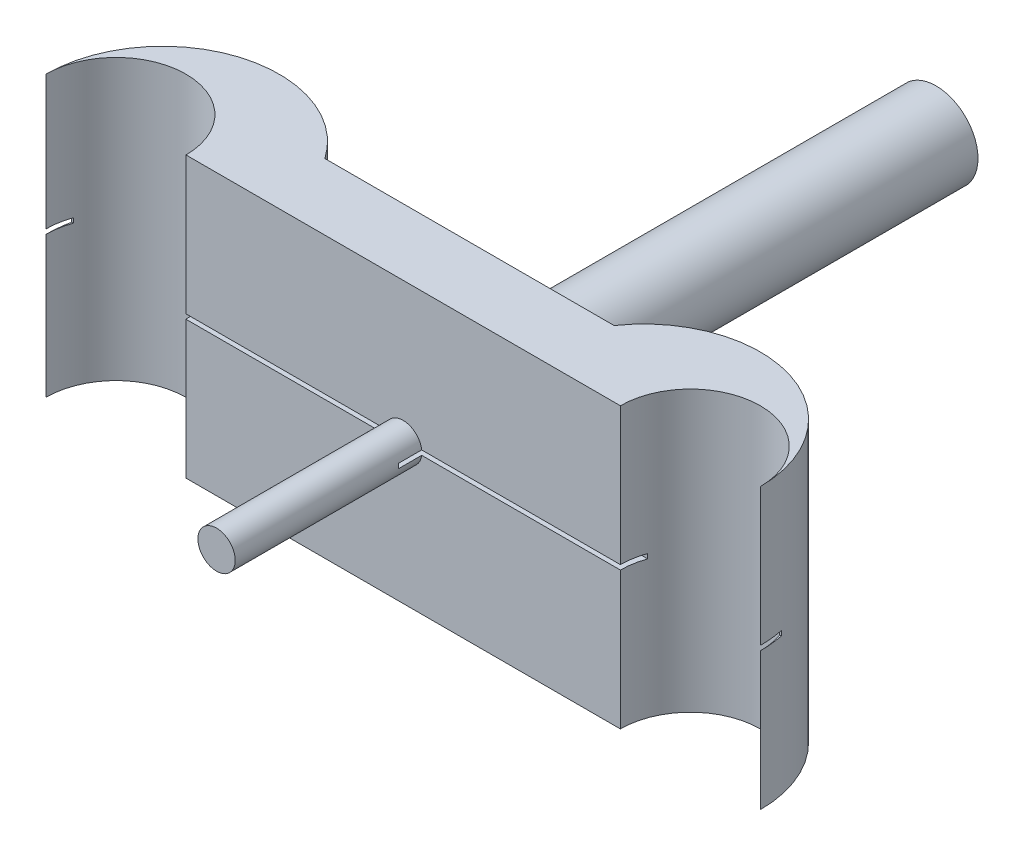
ISO-10303-21;
HEADER;
FILE_DESCRIPTION(('STEP AP214'),'2;1');
FILE_NAME('part.step','',(''),(''),'','','');
FILE_SCHEMA(('AUTOMOTIVE_DESIGN { 1 0 10303 214 1 1 1 1 }'));
ENDSEC;
DATA;
#1=APPLICATION_CONTEXT('core data for automotive mechanical design processes');
#2=APPLICATION_PROTOCOL_DEFINITION('international standard','automotive_design',2000,#1);
#3=PRODUCT_CONTEXT('',#1,'mechanical');
#4=PRODUCT('Part','Part','',(#3));
#5=PRODUCT_RELATED_PRODUCT_CATEGORY('part','',(#4));
#6=PRODUCT_DEFINITION_FORMATION('','',#4);
#7=PRODUCT_DEFINITION_CONTEXT('part definition',#1,'design');
#8=PRODUCT_DEFINITION('design','',#6,#7);
#9=PRODUCT_DEFINITION_SHAPE('','',#8);
#10=(LENGTH_UNIT() NAMED_UNIT(*) SI_UNIT(.MILLI.,.METRE.));
#11=(NAMED_UNIT(*) PLANE_ANGLE_UNIT() SI_UNIT($,.RADIAN.));
#12=(NAMED_UNIT(*) SI_UNIT($,.STERADIAN.) SOLID_ANGLE_UNIT());
#13=UNCERTAINTY_MEASURE_WITH_UNIT(LENGTH_MEASURE(1.E-05),#10,'distance_accuracy_value','');
#14=(GEOMETRIC_REPRESENTATION_CONTEXT(3) GLOBAL_UNCERTAINTY_ASSIGNED_CONTEXT((#13)) GLOBAL_UNIT_ASSIGNED_CONTEXT((#10,
#11,#12)) REPRESENTATION_CONTEXT('',''));
#15=CARTESIAN_POINT('',(0.,0.,0.));
#16=DIRECTION('',(0.,0.,1.));
#17=DIRECTION('',(1.,0.,0.));
#18=AXIS2_PLACEMENT_3D('',#15,#16,#17);
#19=CARTESIAN_POINT('',(0.,30.,0.));
#20=DIRECTION('',(0.,-1.,0.));
#21=DIRECTION('',(0.,0.,-1.));
#22=AXIS2_PLACEMENT_3D('',#19,#20,#21);
#23=CYLINDRICAL_SURFACE('',#22,7.5);
#24=CARTESIAN_POINT('',(0.,14.75,0.));
#25=DIRECTION('',(0.,1.,0.));
#26=DIRECTION('',(0.,0.,1.));
#27=AXIS2_PLACEMENT_3D('',#24,#25,#26);
#28=CIRCLE('',#27,7.5);
#29=CARTESIAN_POINT('',(7.07106781186548,14.75,-2.50000000000001));
#30=VERTEX_POINT('',#29);
#31=CARTESIAN_POINT('',(7.5,14.75,0.));
#32=VERTEX_POINT('',#31);
#33=EDGE_CURVE('E236',#30,#32,#28,.F.);
#34=ORIENTED_EDGE('',*,*,#33,.F.);
#35=DIRECTION('',(0.,-1.,0.));
#36=VECTOR('',#35,1.);
#37=CARTESIAN_POINT('',(7.07106781186547,30.,-2.50000000000001));
#38=LINE('',#37,#36);
#39=CARTESIAN_POINT('',(7.07106781186548,15.25,-2.50000000000001));
#40=VERTEX_POINT('',#39);
#41=EDGE_CURVE('E203',#40,#30,#38,.T.);
#42=ORIENTED_EDGE('',*,*,#41,.F.);
#43=CARTESIAN_POINT('',(0.,15.25,0.));
#44=DIRECTION('',(0.,-1.,0.));
#45=DIRECTION('',(0.,0.,-1.));
#46=AXIS2_PLACEMENT_3D('',#43,#44,#45);
#47=CIRCLE('',#46,7.5);
#48=CARTESIAN_POINT('',(7.5,15.25,0.));
#49=VERTEX_POINT('',#48);
#50=EDGE_CURVE('E208',#49,#40,#47,.F.);
#51=ORIENTED_EDGE('',*,*,#50,.F.);
#52=DIRECTION('',(0.,-1.,0.));
#53=VECTOR('',#52,1.);
#54=CARTESIAN_POINT('',(7.5,30.,0.));
#55=LINE('',#54,#53);
#56=CARTESIAN_POINT('',(7.5,30.,0.));
#57=VERTEX_POINT('',#56);
#58=EDGE_CURVE('E391',#57,#49,#55,.T.);
#59=ORIENTED_EDGE('',*,*,#58,.F.);
#60=CARTESIAN_POINT('',(0.,30.,0.));
#61=DIRECTION('',(0.,-1.,0.));
#62=DIRECTION('',(0.,0.,1.));
#63=AXIS2_PLACEMENT_3D('',#60,#61,#62);
#64=CIRCLE('',#63,7.5);
#65=CARTESIAN_POINT('',(-7.5,30.,0.));
#66=VERTEX_POINT('',#65);
#67=EDGE_CURVE('E480',#66,#57,#64,.T.);
#68=ORIENTED_EDGE('',*,*,#67,.F.);
#69=DIRECTION('',(0.,-1.,0.));
#70=VECTOR('',#69,1.);
#71=CARTESIAN_POINT('',(-7.5,30.,0.));
#72=LINE('',#71,#70);
#73=CARTESIAN_POINT('',(-7.5,15.6319903693811,0.));
#74=VERTEX_POINT('',#73);
#75=EDGE_CURVE('E390',#66,#74,#72,.T.);
#76=ORIENTED_EDGE('',*,*,#75,.T.);
#77=CARTESIAN_POINT('',(0.,15.6319903693811,0.));
#78=DIRECTION('',(0.,1.,0.));
#79=DIRECTION('',(0.,0.,1.));
#80=AXIS2_PLACEMENT_3D('',#77,#78,#79);
#81=CIRCLE('',#80,7.5);
#82=CARTESIAN_POINT('',(-7.07106781186547,15.6319903693811,-2.5));
#83=VERTEX_POINT('',#82);
#84=EDGE_CURVE('E407',#74,#83,#81,.F.);
#85=ORIENTED_EDGE('',*,*,#84,.T.);
#86=DIRECTION('',(0.,-1.,0.));
#87=VECTOR('',#86,1.);
#88=CARTESIAN_POINT('',(-7.07106781186547,30.,-2.50000000000002));
#89=LINE('',#88,#87);
#90=CARTESIAN_POINT('',(-7.07106781186547,15.1319903693811,-2.5));
#91=VERTEX_POINT('',#90);
#92=EDGE_CURVE('E411',#83,#91,#89,.T.);
#93=ORIENTED_EDGE('',*,*,#92,.T.);
#94=CARTESIAN_POINT('',(0.,15.1319903693811,0.));
#95=DIRECTION('',(0.,-1.,0.));
#96=DIRECTION('',(0.,0.,-1.));
#97=AXIS2_PLACEMENT_3D('',#94,#95,#96);
#98=CIRCLE('',#97,7.5);
#99=CARTESIAN_POINT('',(-7.5,15.1319903693811,0.));
#100=VERTEX_POINT('',#99);
#101=EDGE_CURVE('E415',#91,#100,#98,.F.);
#102=ORIENTED_EDGE('',*,*,#101,.T.);
#103=CARTESIAN_POINT('',(-7.5,0.,0.));
#104=VERTEX_POINT('',#103);
#105=EDGE_CURVE('E382',#100,#104,#72,.T.);
#106=ORIENTED_EDGE('',*,*,#105,.T.);
#107=CARTESIAN_POINT('',(0.,0.,0.));
#108=DIRECTION('',(0.,-1.,0.));
#109=DIRECTION('',(0.,0.,1.));
#110=AXIS2_PLACEMENT_3D('',#107,#108,#109);
#111=CIRCLE('',#110,7.5);
#112=CARTESIAN_POINT('',(7.5,0.,0.));
#113=VERTEX_POINT('',#112);
#114=EDGE_CURVE('E499',#104,#113,#111,.T.);
#115=ORIENTED_EDGE('',*,*,#114,.T.);
#116=EDGE_CURVE('E399',#32,#113,#55,.T.);
#117=ORIENTED_EDGE('',*,*,#116,.F.);
#118=EDGE_LOOP('',(#34,#42,#51,#59,#68,#76,#85,#93,#102,#106,#115,#117));
#119=FACE_BOUND('',#118,.T.);
#120=ADVANCED_FACE('F55',(#119),#23,.F.);
#121=CARTESIAN_POINT('',(7.5,30.,0.));
#122=DIRECTION('',(0.,0.,-1.));
#123=DIRECTION('',(-1.,0.,0.));
#124=AXIS2_PLACEMENT_3D('',#121,#122,#123);
#125=PLANE('',#124);
#126=DIRECTION('',(1.,0.,0.));
#127=VECTOR('',#126,1.);
#128=CARTESIAN_POINT('',(7.5,14.75,0.));
#129=LINE('',#128,#127);
#130=CARTESIAN_POINT('',(28.7956865167016,14.75,0.));
#131=VERTEX_POINT('',#130);
#132=EDGE_CURVE('E233',#32,#131,#129,.T.);
#133=ORIENTED_EDGE('',*,*,#132,.F.);
#134=ORIENTED_EDGE('',*,*,#116,.T.);
#135=DIRECTION('',(1.,0.,0.));
#136=VECTOR('',#135,1.);
#137=CARTESIAN_POINT('',(7.5,0.,0.));
#138=LINE('',#137,#136);
#139=CARTESIAN_POINT('',(54.06,0.,0.));
#140=VERTEX_POINT('',#139);
#141=EDGE_CURVE('E503',#113,#140,#138,.T.);
#142=ORIENTED_EDGE('',*,*,#141,.T.);
#143=DIRECTION('',(0.,-1.,0.));
#144=VECTOR('',#143,1.);
#145=CARTESIAN_POINT('',(54.06,30.,0.));
#146=LINE('',#145,#144);
#147=CARTESIAN_POINT('',(54.06,14.75,0.));
#148=VERTEX_POINT('',#147);
#149=EDGE_CURVE('E457',#148,#140,#146,.T.);
#150=ORIENTED_EDGE('',*,*,#149,.F.);
#151=CARTESIAN_POINT('',(32.7643134832984,14.75,0.));
#152=VERTEX_POINT('',#151);
#153=EDGE_CURVE('E237',#152,#148,#129,.T.);
#154=ORIENTED_EDGE('',*,*,#153,.F.);
#155=CARTESIAN_POINT('',(30.78,15.,0.));
#156=DIRECTION('',(0.,0.,-1.));
#157=DIRECTION('',(-1.,0.,0.));
#158=AXIS2_PLACEMENT_3D('',#155,#156,#157);
#159=CIRCLE('',#158,2.);
#160=EDGE_CURVE('E403',#131,#152,#159,.F.);
#161=ORIENTED_EDGE('',*,*,#160,.F.);
#162=EDGE_LOOP('',(#133,#134,#142,#150,#154,#161));
#163=FACE_BOUND('',#162,.T.);
#164=ADVANCED_FACE('F356',(#163),#125,.F.);
#165=DIRECTION('',(-1.,0.,0.));
#166=VECTOR('',#165,1.);
#167=CARTESIAN_POINT('',(7.5,15.25,0.));
#168=LINE('',#167,#166);
#169=CARTESIAN_POINT('',(54.06,15.25,0.));
#170=VERTEX_POINT('',#169);
#171=CARTESIAN_POINT('',(32.7643134832984,15.25,0.));
#172=VERTEX_POINT('',#171);
#173=EDGE_CURVE('E76',#170,#172,#168,.T.);
#174=ORIENTED_EDGE('',*,*,#173,.F.);
#175=CARTESIAN_POINT('',(54.06,30.,0.));
#176=VERTEX_POINT('',#175);
#177=EDGE_CURVE('E215',#176,#170,#146,.T.);
#178=ORIENTED_EDGE('',*,*,#177,.F.);
#179=DIRECTION('',(1.,0.,0.));
#180=VECTOR('',#179,1.);
#181=CARTESIAN_POINT('',(7.5,30.,0.));
#182=LINE('',#181,#180);
#183=EDGE_CURVE('E476',#57,#176,#182,.T.);
#184=ORIENTED_EDGE('',*,*,#183,.F.);
#185=ORIENTED_EDGE('',*,*,#58,.T.);
#186=CARTESIAN_POINT('',(28.7956865167016,15.25,0.));
#187=VERTEX_POINT('',#186);
#188=EDGE_CURVE('E222',#187,#49,#168,.T.);
#189=ORIENTED_EDGE('',*,*,#188,.F.);
#190=EDGE_CURVE('E397',#172,#187,#159,.F.);
#191=ORIENTED_EDGE('',*,*,#190,.F.);
#192=EDGE_LOOP('',(#174,#178,#184,#185,#189,#191));
#193=FACE_BOUND('',#192,.T.);
#194=ADVANCED_FACE('F362',(#193),#125,.F.);
#195=CARTESIAN_POINT('',(61.56,30.,0.));
#196=DIRECTION('',(0.,-1.,0.));
#197=DIRECTION('',(0.,0.,-1.));
#198=AXIS2_PLACEMENT_3D('',#195,#196,#197);
#199=CYLINDRICAL_SURFACE('',#198,7.50000000000001);
#200=CARTESIAN_POINT('',(61.56,14.75,0.));
#201=DIRECTION('',(0.,1.,0.));
#202=DIRECTION('',(0.,0.,1.));
#203=AXIS2_PLACEMENT_3D('',#200,#201,#202);
#204=CIRCLE('',#203,7.50000000000001);
#205=CARTESIAN_POINT('',(54.4889321881345,14.75,-2.50000000000001));
#206=VERTEX_POINT('',#205);
#207=EDGE_CURVE('E243',#148,#206,#204,.F.);
#208=ORIENTED_EDGE('',*,*,#207,.F.);
#209=ORIENTED_EDGE('',*,*,#149,.T.);
#210=CARTESIAN_POINT('',(61.56,0.,0.));
#211=DIRECTION('',(0.,-1.,0.));
#212=DIRECTION('',(0.,0.,1.));
#213=AXIS2_PLACEMENT_3D('',#210,#211,#212);
#214=CIRCLE('',#213,7.50000000000001);
#215=CARTESIAN_POINT('',(69.06,0.,0.));
#216=VERTEX_POINT('',#215);
#217=EDGE_CURVE('E506',#140,#216,#214,.T.);
#218=ORIENTED_EDGE('',*,*,#217,.T.);
#219=DIRECTION('',(0.,-1.,0.));
#220=VECTOR('',#219,1.);
#221=CARTESIAN_POINT('',(69.06,30.,0.));
#222=LINE('',#221,#220);
#223=CARTESIAN_POINT('',(69.06,14.7500000000002,0.));
#224=VERTEX_POINT('',#223);
#225=EDGE_CURVE('E522',#224,#216,#222,.T.);
#226=ORIENTED_EDGE('',*,*,#225,.F.);
#227=CARTESIAN_POINT('',(61.56,14.7500000000002,0.));
#228=DIRECTION('',(0.,-1.,0.));
#229=DIRECTION('',(1.,0.,0.));
#230=AXIS2_PLACEMENT_3D('',#227,#228,#229);
#231=CIRCLE('',#230,7.50000000000001);
#232=CARTESIAN_POINT('',(68.6310678118655,14.7500000000002,-2.50000000000001));
#233=VERTEX_POINT('',#232);
#234=EDGE_CURVE('E262',#224,#233,#231,.F.);
#235=ORIENTED_EDGE('',*,*,#234,.T.);
#236=DIRECTION('',(0.,-1.,0.));
#237=VECTOR('',#236,1.);
#238=CARTESIAN_POINT('',(68.6310678118655,30.,-2.50000000000001));
#239=LINE('',#238,#237);
#240=CARTESIAN_POINT('',(68.6310678118655,15.2500000000002,-2.50000000000001));
#241=VERTEX_POINT('',#240);
#242=EDGE_CURVE('E258',#233,#241,#239,.F.);
#243=ORIENTED_EDGE('',*,*,#242,.T.);
#244=CARTESIAN_POINT('',(61.56,15.2500000000002,0.));
#245=DIRECTION('',(0.,1.,0.));
#246=DIRECTION('',(-1.,0.,0.));
#247=AXIS2_PLACEMENT_3D('',#244,#245,#246);
#248=CIRCLE('',#247,7.50000000000001);
#249=CARTESIAN_POINT('',(69.06,15.2500000000002,0.));
#250=VERTEX_POINT('',#249);
#251=EDGE_CURVE('E251',#241,#250,#248,.F.);
#252=ORIENTED_EDGE('',*,*,#251,.T.);
#253=CARTESIAN_POINT('',(69.06,30.,0.));
#254=VERTEX_POINT('',#253);
#255=EDGE_CURVE('E523',#254,#250,#222,.T.);
#256=ORIENTED_EDGE('',*,*,#255,.F.);
#257=CARTESIAN_POINT('',(61.56,30.,0.));
#258=DIRECTION('',(0.,-1.,0.));
#259=DIRECTION('',(0.,0.,1.));
#260=AXIS2_PLACEMENT_3D('',#257,#258,#259);
#261=CIRCLE('',#260,7.50000000000001);
#262=EDGE_CURVE('E479',#176,#254,#261,.T.);
#263=ORIENTED_EDGE('',*,*,#262,.F.);
#264=ORIENTED_EDGE('',*,*,#177,.T.);
#265=CARTESIAN_POINT('',(61.56,15.25,0.));
#266=DIRECTION('',(0.,-1.,0.));
#267=DIRECTION('',(0.,0.,-1.));
#268=AXIS2_PLACEMENT_3D('',#265,#266,#267);
#269=CIRCLE('',#268,7.50000000000001);
#270=CARTESIAN_POINT('',(54.4889321881345,15.25,-2.50000000000001));
#271=VERTEX_POINT('',#270);
#272=EDGE_CURVE('E206',#271,#170,#269,.F.);
#273=ORIENTED_EDGE('',*,*,#272,.F.);
#274=DIRECTION('',(0.,-1.,0.));
#275=VECTOR('',#274,1.);
#276=CARTESIAN_POINT('',(54.4889321881345,30.,-2.50000000000001));
#277=LINE('',#276,#275);
#278=EDGE_CURVE('E192',#206,#271,#277,.F.);
#279=ORIENTED_EDGE('',*,*,#278,.F.);
#280=EDGE_LOOP('',(#208,#209,#218,#226,#235,#243,#252,#256,#263,#264,#273,#279));
#281=FACE_BOUND('',#280,.T.);
#282=ADVANCED_FACE('F212',(#281),#199,.F.);
#283=CARTESIAN_POINT('',(30.78,15.,20.));
#284=DIRECTION('',(0.,0.,-1.));
#285=DIRECTION('',(-1.,0.,0.));
#286=AXIS2_PLACEMENT_3D('',#283,#284,#285);
#287=CYLINDRICAL_SURFACE('',#286,2.);
#288=CARTESIAN_POINT('',(30.78,15.,20.));
#289=DIRECTION('',(0.,0.,1.));
#290=DIRECTION('',(1.,0.,0.));
#291=AXIS2_PLACEMENT_3D('',#288,#289,#290);
#292=CIRCLE('',#291,2.);
#293=CARTESIAN_POINT('',(32.78,15.,20.));
#294=VERTEX_POINT('',#293);
#295=EDGE_CURVE('E285',#294,#294,#292,.T.);
#296=ORIENTED_EDGE('',*,*,#295,.F.);
#297=EDGE_LOOP('',(#296));
#298=FACE_BOUND('',#297,.T.);
#299=DIRECTION('',(0.,0.,-1.));
#300=VECTOR('',#299,1.);
#301=CARTESIAN_POINT('',(28.7956865167016,14.75,20.));
#302=LINE('',#301,#300);
#303=CARTESIAN_POINT('',(28.7956865167016,14.75,2.49999999999998));
#304=VERTEX_POINT('',#303);
#305=EDGE_CURVE('E230',#131,#304,#302,.F.);
#306=ORIENTED_EDGE('',*,*,#305,.F.);
#307=ORIENTED_EDGE('',*,*,#160,.T.);
#308=DIRECTION('',(0.,0.,-1.));
#309=VECTOR('',#308,1.);
#310=CARTESIAN_POINT('',(32.7643134832984,14.75,20.));
#311=LINE('',#310,#309);
#312=CARTESIAN_POINT('',(32.7643134832984,14.75,2.49999999999998));
#313=VERTEX_POINT('',#312);
#314=EDGE_CURVE('E240',#313,#152,#311,.T.);
#315=ORIENTED_EDGE('',*,*,#314,.F.);
#316=CARTESIAN_POINT('',(30.78,15.,2.49999999999998));
#317=DIRECTION('',(0.,0.,-1.));
#318=DIRECTION('',(-1.,0.,0.));
#319=AXIS2_PLACEMENT_3D('',#316,#317,#318);
#320=CIRCLE('',#319,2.);
#321=CARTESIAN_POINT('',(32.7643134832984,15.25,2.49999999999999));
#322=VERTEX_POINT('',#321);
#323=EDGE_CURVE('E59',#322,#313,#320,.T.);
#324=ORIENTED_EDGE('',*,*,#323,.F.);
#325=DIRECTION('',(0.,0.,-1.));
#326=VECTOR('',#325,1.);
#327=CARTESIAN_POINT('',(32.7643134832984,15.25,20.));
#328=LINE('',#327,#326);
#329=EDGE_CURVE('E224',#172,#322,#328,.F.);
#330=ORIENTED_EDGE('',*,*,#329,.F.);
#331=ORIENTED_EDGE('',*,*,#190,.T.);
#332=DIRECTION('',(0.,0.,-1.));
#333=VECTOR('',#332,1.);
#334=CARTESIAN_POINT('',(28.7956865167016,15.25,20.));
#335=LINE('',#334,#333);
#336=CARTESIAN_POINT('',(28.7956865167016,15.25,2.49999999999998));
#337=VERTEX_POINT('',#336);
#338=EDGE_CURVE('E217',#337,#187,#335,.T.);
#339=ORIENTED_EDGE('',*,*,#338,.F.);
#340=EDGE_CURVE('E14',#304,#337,#320,.T.);
#341=ORIENTED_EDGE('',*,*,#340,.F.);
#342=EDGE_LOOP('',(#306,#307,#315,#324,#330,#331,#339,#341));
#343=FACE_BOUND('',#342,.T.);
#344=ADVANCED_FACE('F309',(#298,#343),#287,.T.);
#345=CARTESIAN_POINT('',(30.78,15.,-57.1093421296713));
#346=DIRECTION('',(0.,0.,1.));
#347=DIRECTION('',(1.,0.,0.));
#348=AXIS2_PLACEMENT_3D('',#345,#346,#347);
#349=CYLINDRICAL_SURFACE('',#348,4.5);
#350=CARTESIAN_POINT('',(30.78,15.,-7.60934212967128));
#351=DIRECTION('',(0.,0.,1.));
#352=DIRECTION('',(1.,0.,0.));
#353=AXIS2_PLACEMENT_3D('',#350,#351,#352);
#354=CIRCLE('',#353,4.5);
#355=CARTESIAN_POINT('',(35.28,15.,-7.60934212967128));
#356=VERTEX_POINT('',#355);
#357=EDGE_CURVE('E430',#356,#356,#354,.F.);
#358=ORIENTED_EDGE('',*,*,#357,.T.);
#359=EDGE_LOOP('',(#358));
#360=FACE_BOUND('',#359,.T.);
#361=CARTESIAN_POINT('',(30.78,15.,-57.1093421296713));
#362=DIRECTION('',(0.,0.,-1.));
#363=DIRECTION('',(-1.,0.,0.));
#364=AXIS2_PLACEMENT_3D('',#361,#362,#363);
#365=CIRCLE('',#364,4.5);
#366=CARTESIAN_POINT('',(26.28,15.,-57.1093421296713));
#367=VERTEX_POINT('',#366);
#368=EDGE_CURVE('E500',#367,#367,#365,.T.);
#369=ORIENTED_EDGE('',*,*,#368,.F.);
#370=EDGE_LOOP('',(#369));
#371=FACE_BOUND('',#370,.T.);
#372=CARTESIAN_POINT('',(26.28,15.,-51.5423443036595));
#373=CARTESIAN_POINT('',(26.2799997704858,15.0818450443301,-51.5423439230621));
#374=CARTESIAN_POINT('',(26.2822534573868,15.1636877918078,-51.5490647028503));
#375=CARTESIAN_POINT('',(26.2910218469508,15.3249626413095,-51.5756879668853));
#376=CARTESIAN_POINT('',(26.2975369919677,15.4043944921782,-51.5955918195829));
#377=CARTESIAN_POINT('',(26.3141203814034,15.5584991842527,-51.6478231687356));
#378=CARTESIAN_POINT('',(26.3241826840372,15.6331797388291,-51.6801298973484));
#379=CARTESIAN_POINT('',(26.3468333142399,15.776062405208,-51.756156062917));
#380=CARTESIAN_POINT('',(26.3594221399833,15.8442632354381,-51.7998777511634));
#381=CARTESIAN_POINT('',(26.3862885833549,15.9746125125334,-51.8990830109476));
#382=CARTESIAN_POINT('',(26.4006066530432,16.0365055504475,-51.9548911550503));
#383=CARTESIAN_POINT('',(26.4290952782532,16.1502490390531,-52.0759950357194));
#384=CARTESIAN_POINT('',(26.4432658006418,16.2020972782342,-52.1412928560523));
#385=CARTESIAN_POINT('',(26.4703000128409,16.2957374133418,-52.2818219764542));
#386=CARTESIAN_POINT('',(26.4831144108647,16.3371972873315,-52.3572849132577));
#387=CARTESIAN_POINT('',(26.505370418721,16.4067283108166,-52.5146084453473));
#388=CARTESIAN_POINT('',(26.5148130575888,16.4348035460801,-52.5964670794036));
#389=CARTESIAN_POINT('',(26.5288304509593,16.4758101922637,-52.7613541359046));
#390=CARTESIAN_POINT('',(26.5335585634558,16.4892201724077,-52.8442501163931));
#391=CARTESIAN_POINT('',(26.5380651505574,16.5020116850017,-53.0112399348933));
#392=CARTESIAN_POINT('',(26.537845154659,16.5013975524071,-53.0953333947233));
#393=CARTESIAN_POINT('',(26.5326147748773,16.4865298555551,-53.2582492493256));
#394=CARTESIAN_POINT('',(26.527823761987,16.4729008697505,-53.337136908038));
#395=CARTESIAN_POINT('',(26.5143501341317,16.4334092442741,-53.4914344330698));
#396=CARTESIAN_POINT('',(26.5056670532384,16.4075451398878,-53.5668438818121));
#397=CARTESIAN_POINT('',(26.4852313330313,16.3439085870903,-53.7134634280467));
#398=CARTESIAN_POINT('',(26.4734315131032,16.3059510730609,-53.7845863418638));
#399=CARTESIAN_POINT('',(26.4481116213641,16.2193336594547,-53.9196506660791));
#400=CARTESIAN_POINT('',(26.434591053143,16.170670668546,-53.9835899940596));
#401=CARTESIAN_POINT('',(26.4064900624839,16.0610239990234,-54.1059817009007));
#402=CARTESIAN_POINT('',(26.3918911596774,15.9995297251145,-54.1639733454231));
#403=CARTESIAN_POINT('',(26.3638959241944,15.8675093549551,-54.2689412036546));
#404=CARTESIAN_POINT('',(26.350499706929,15.7969823934912,-54.3159163609063));
#405=CARTESIAN_POINT('',(26.3262433809331,15.6479214195694,-54.3978887540121));
#406=CARTESIAN_POINT('',(26.3154097498794,15.5693149146245,-54.4327625406706));
#407=CARTESIAN_POINT('',(26.2976914928335,15.4069036250468,-54.4886490645931));
#408=CARTESIAN_POINT('',(26.2908054951768,15.3231006572324,-54.5096666167947));
#409=CARTESIAN_POINT('',(26.2819855939284,15.156575744294,-54.5364278026931));
#410=CARTESIAN_POINT('',(26.2798499724941,15.0739643997973,-54.5427940174187));
#411=CARTESIAN_POINT('',(26.2801664595776,14.9088373950596,-54.5418452932618));
#412=CARTESIAN_POINT('',(26.2826177937096,14.8263217210205,-54.5345326636897));
#413=CARTESIAN_POINT('',(26.2916996292434,14.6662202005436,-54.5069264420556));
#414=CARTESIAN_POINT('',(26.2982070193321,14.5885607897477,-54.4870149945853));
#415=CARTESIAN_POINT('',(26.3146222975489,14.4377160621306,-54.4352541369594));
#416=CARTESIAN_POINT('',(26.3245306192999,14.3645313172371,-54.4034032044578));
#417=CARTESIAN_POINT('',(26.3470660306907,14.2225675554101,-54.3277386558983));
#418=CARTESIAN_POINT('',(26.3597577786632,14.1539550611743,-54.2836324137348));
#419=CARTESIAN_POINT('',(26.3864211912561,14.0249027547966,-54.1850530786393));
#420=CARTESIAN_POINT('',(26.4003932460926,13.9644654483066,-54.1305768196119));
#421=CARTESIAN_POINT('',(26.4288472802933,13.8506212382905,-54.0098761771496));
#422=CARTESIAN_POINT('',(26.4433235836886,13.7976585461313,-53.9432304632692));
#423=CARTESIAN_POINT('',(26.4705004005794,13.7036137165146,-53.8016869519432));
#424=CARTESIAN_POINT('',(26.48320089927,13.6625316781035,-53.7267890857084));
#425=CARTESIAN_POINT('',(26.5052641231292,13.5936046043755,-53.5708347807247));
#426=CARTESIAN_POINT('',(26.5146335881053,13.5657328017525,-53.4897911849064));
#427=CARTESIAN_POINT('',(26.5288375154033,13.524157999861,-53.3237763285933));
#428=CARTESIAN_POINT('',(26.5336740206454,13.5104486175691,-53.238806855553));
#429=CARTESIAN_POINT('',(26.5380321168873,13.498085576284,-53.0720486595981));
#430=CARTESIAN_POINT('',(26.5378139961388,13.4986946140374,-52.9903207932293));
#431=CARTESIAN_POINT('',(26.532730952642,13.513136559827,-52.8281966912764));
#432=CARTESIAN_POINT('',(26.5278663064596,13.5269686808121,-52.7478003767269));
#433=CARTESIAN_POINT('',(26.5142321354266,13.566942280306,-52.5921408091558));
#434=CARTESIAN_POINT('',(26.5055385296628,13.5928449809767,-52.5168090661528));
#435=CARTESIAN_POINT('',(26.485254017723,13.6560309513604,-52.3715031932521));
#436=CARTESIAN_POINT('',(26.4736624685491,13.6933167471693,-52.3015302568775));
#437=CARTESIAN_POINT('',(26.4482575616093,13.7801089611249,-52.1656187987752));
#438=CARTESIAN_POINT('',(26.4343693253679,13.8300776358531,-52.0999895508119));
#439=CARTESIAN_POINT('',(26.4062496557512,13.9400356752965,-51.9778095835832));
#440=CARTESIAN_POINT('',(26.3920181263144,14.0000278733228,-51.9212614401274));
#441=CARTESIAN_POINT('',(26.3641495421168,14.131137664619,-51.8166276852258));
#442=CARTESIAN_POINT('',(26.3505572729811,14.2025977297504,-51.768957782033));
#443=CARTESIAN_POINT('',(26.3261101324108,14.3529639638901,-51.6863586603835));
#444=CARTESIAN_POINT('',(26.315254561381,14.4318682228015,-51.6514261847765));
#445=CARTESIAN_POINT('',(26.2979172739719,14.5912595291985,-51.5967618549265));
#446=CARTESIAN_POINT('',(26.2912618136622,14.6715183634854,-51.5764206042644));
#447=CARTESIAN_POINT('',(26.2823038940367,14.8345193759846,-51.5492138826438));
#448=CARTESIAN_POINT('',(26.2800002320214,14.9172608616469,-51.5423446884147));
#449=CARTESIAN_POINT('',(26.28,15.,-51.5423443036595));
#450=B_SPLINE_CURVE_WITH_KNOTS('',3,(#372,#373,#374,#375,#376,#377,#378,#379,#380,#381,#382,
#383,#384,#385,#386,#387,#388,#389,#390,#391,#392,#393,#394,#395,#396,#397,#398,#399,#400,#401,
#402,#403,#404,#405,#406,#407,#408,#409,#410,#411,#412,#413,#414,#415,#416,#417,#418,#419,#420,
#421,#422,#423,#424,#425,#426,#427,#428,#429,#430,#431,#432,#433,#434,#435,#436,#437,#438,#439,
#440,#441,#442,#443,#444,#445,#446,#447,#448,#449),.UNSPECIFIED.,.T.,.F.,(4,2,2,2,2,2,2,2,2,2,2,
2,2,2,2,2,2,2,2,2,2,2,2,2,2,2,2,2,2,2,2,2,2,2,2,2,2,2,4),(0.,0.245230659039017,
0.490486777901283,0.735334009305415,0.980229566698659,1.23277026424135,1.48536649931296,
1.74522577235206,2.0050056703925,2.2560288861276,2.50697450981229,2.74645239826921,
2.98595896283225,3.22932256732696,3.47275653837311,3.72889958717052,3.98506718949929,
4.24377608475538,4.50239503315814,4.74980374762756,4.99717069746266,5.23737236967322,
5.47760467926157,5.72415599765606,5.97078271232838,6.22861534321129,6.48645012352496,
6.74376020740158,7.00095427058762,7.24493499096389,7.48890119027064,7.72823380620628,
7.96761957263968,8.21745100037708,8.46735316685669,8.72699491252652,8.98657021728686,
9.23454837560722,9.48245799057212),.UNSPECIFIED.);
#451=CARTESIAN_POINT('',(26.28,15.,-51.5423443036595));
#452=VERTEX_POINT('',#451);
#453=EDGE_CURVE('E298',#452,#452,#450,.T.);
#454=ORIENTED_EDGE('',*,*,#453,.F.);
#455=EDGE_LOOP('',(#454));
#456=FACE_BOUND('',#455,.T.);
#457=ADVANCED_FACE('F312',(#360,#371,#456),#349,.T.);
#458=CARTESIAN_POINT('',(30.78,15.,-57.1093421296713));
#459=DIRECTION('',(0.,0.,1.));
#460=DIRECTION('',(1.,0.,0.));
#461=AXIS2_PLACEMENT_3D('',#458,#459,#460);
#462=CYLINDRICAL_SURFACE('',#461,2.5);
#463=CARTESIAN_POINT('',(30.78,15.,-7.10934212967127));
#464=DIRECTION('',(0.,0.,-1.));
#465=DIRECTION('',(-1.,0.,0.));
#466=AXIS2_PLACEMENT_3D('',#463,#464,#465);
#467=CIRCLE('',#466,2.5);
#468=CARTESIAN_POINT('',(28.28,15.,-7.10934212967127));
#469=VERTEX_POINT('',#468);
#470=EDGE_CURVE('E568',#469,#469,#467,.T.);
#471=ORIENTED_EDGE('',*,*,#470,.F.);
#472=EDGE_LOOP('',(#471));
#473=FACE_BOUND('',#472,.T.);
#474=CARTESIAN_POINT('',(30.78,15.,-57.1093421296713));
#475=DIRECTION('',(0.,0.,-1.));
#476=DIRECTION('',(-1.,0.,0.));
#477=AXIS2_PLACEMENT_3D('',#474,#475,#476);
#478=CIRCLE('',#477,2.5);
#479=CARTESIAN_POINT('',(28.28,15.,-57.1093421296713));
#480=VERTEX_POINT('',#479);
#481=EDGE_CURVE('E567',#480,#480,#478,.T.);
#482=ORIENTED_EDGE('',*,*,#481,.T.);
#483=EDGE_LOOP('',(#482));
#484=FACE_BOUND('',#483,.T.);
#485=CARTESIAN_POINT('',(28.28,15.,-51.5423443036595));
#486=CARTESIAN_POINT('',(28.2800037421027,14.923270166538,-51.5423483946694));
#487=CARTESIAN_POINT('',(28.2835709538499,14.8464176793558,-51.5482729745858));
#488=CARTESIAN_POINT('',(28.2975009639143,14.6950244904693,-51.5716686231748));
#489=CARTESIAN_POINT('',(28.3078805196728,14.620489965404,-51.5891681655137));
#490=CARTESIAN_POINT('',(28.3343844194551,14.4762481722092,-51.6347306648264));
#491=CARTESIAN_POINT('',(28.3504802672706,14.4065189717734,-51.6627412618227));
#492=CARTESIAN_POINT('',(28.3870463237359,14.2729696817853,-51.7282046368005));
#493=CARTESIAN_POINT('',(28.4075154461975,14.2091481305836,-51.7656550706283));
#494=CARTESIAN_POINT('',(28.4529463928091,14.0837007210007,-51.8521191303681));
#495=CARTESIAN_POINT('',(28.4781320780402,14.0226159799186,-51.9017979990109));
#496=CARTESIAN_POINT('',(28.5296956072037,13.9091172958811,-52.0098115074878));
#497=CARTESIAN_POINT('',(28.5560749484643,13.8567146505189,-52.0681572408468));
#498=CARTESIAN_POINT('',(28.6108893300409,13.7555500323703,-52.2002678141562));
#499=CARTESIAN_POINT('',(28.6391798229635,13.7080223362119,-52.2750460746408));
#500=CARTESIAN_POINT('',(28.6906169858788,13.626385622351,-52.4331908769026));
#501=CARTESIAN_POINT('',(28.7137719772606,13.5922548266484,-52.5165431999071));
#502=CARTESIAN_POINT('',(28.7464537033907,13.5455939828578,-52.6689407543128));
#503=CARTESIAN_POINT('',(28.7579211686241,13.5298380275317,-52.7365803022698));
#504=CARTESIAN_POINT('',(28.774096917045,13.5078382765952,-52.8741480194899));
#505=CARTESIAN_POINT('',(28.7788136035624,13.5015826544316,-52.944073232414));
#506=CARTESIAN_POINT('',(28.7807907753614,13.4989449120399,-53.0843557978768));
#507=CARTESIAN_POINT('',(28.7780366298728,13.5025821659158,-53.1547137287527));
#508=CARTESIAN_POINT('',(28.7654673855626,13.5195393952117,-53.2936230790871));
#509=CARTESIAN_POINT('',(28.7556469756777,13.532866653799,-53.362173099507));
#510=CARTESIAN_POINT('',(28.7304681305574,13.5682607811821,-53.4948745457876));
#511=CARTESIAN_POINT('',(28.7151828834746,13.5902125133391,-53.559071357584));
#512=CARTESIAN_POINT('',(28.6807294864917,13.6420493822916,-53.6830392945876));
#513=CARTESIAN_POINT('',(28.6615599137654,13.6719374274029,-53.7428087870834));
#514=CARTESIAN_POINT('',(28.6174467273102,13.7448201681542,-53.8673284007823));
#515=CARTESIAN_POINT('',(28.5920795662701,13.7891927560228,-53.9311223966144));
#516=CARTESIAN_POINT('',(28.5406940023562,13.88708907216,-54.0510207873265));
#517=CARTESIAN_POINT('',(28.5146749973785,13.9406215489942,-54.107117737636));
#518=CARTESIAN_POINT('',(28.4606449504168,14.064188165617,-54.2179572854813));
#519=CARTESIAN_POINT('',(28.4328616373147,14.135482317295,-54.2714216096755));
#520=CARTESIAN_POINT('',(28.3822757156602,14.287723949541,-54.3654663508574));
#521=CARTESIAN_POINT('',(28.3594704457449,14.3686662360564,-54.4060536574495));
#522=CARTESIAN_POINT('',(28.3226960793385,14.5328024147318,-54.4702764864554));
#523=CARTESIAN_POINT('',(28.308260425603,14.6155323758264,-54.4948196593754));
#524=CARTESIAN_POINT('',(28.2878115718645,14.7849521048553,-54.5293555010649));
#525=CARTESIAN_POINT('',(28.2817882704726,14.8716369943387,-54.5393656214131));
#526=CARTESIAN_POINT('',(28.2790942962539,15.0337146143774,-54.5438521513378));
#527=CARTESIAN_POINT('',(28.2812647828571,15.1090424734187,-54.5402531587447));
#528=CARTESIAN_POINT('',(28.2922128791295,15.257829401986,-54.5219184505876));
#529=CARTESIAN_POINT('',(28.3009903548196,15.3312885093761,-54.5071829608537));
#530=CARTESIAN_POINT('',(28.3240520755781,15.4725749321576,-54.4678008708471));
#531=CARTESIAN_POINT('',(28.3381972433744,15.5404957509285,-54.4434039545861));
#532=CARTESIAN_POINT('',(28.3708611913716,15.6712657490872,-54.3856669272943));
#533=CARTESIAN_POINT('',(28.3893808341349,15.7341139249639,-54.3523250523129));
#534=CARTESIAN_POINT('',(28.4315450376264,15.8600062628238,-54.2737873244508));
#535=CARTESIAN_POINT('',(28.4555219726012,15.9223941504568,-54.2277204745811));
#536=CARTESIAN_POINT('',(28.5052573442527,16.0390260313101,-54.1269529101709));
#537=CARTESIAN_POINT('',(28.5310178341364,16.0932604027374,-54.072242148807));
#538=CARTESIAN_POINT('',(28.5855457609011,16.1993199673558,-53.9474339136224));
#539=CARTESIAN_POINT('',(28.6142675825371,16.2499101963091,-53.876260418194));
#540=CARTESIAN_POINT('',(28.6678381793329,16.3384523891567,-53.7251282790913));
#541=CARTESIAN_POINT('',(28.6926910200231,16.3764176676978,-53.6451790097667));
#542=CARTESIAN_POINT('',(28.7301509075948,16.4314257879578,-53.4961012813528));
#543=CARTESIAN_POINT('',(28.7442434067127,16.4512162533619,-53.4283639913009));
#544=CARTESIAN_POINT('',(28.7659039425646,16.4811366390597,-53.2898122255794));
#545=CARTESIAN_POINT('',(28.7734810235728,16.4912799529763,-53.2190021593317));
#546=CARTESIAN_POINT('',(28.7809955338373,16.5013413041663,-53.0759673560625));
#547=CARTESIAN_POINT('',(28.7809042355406,16.5012208910787,-53.0037383129725));
#548=CARTESIAN_POINT('',(28.7730228210715,16.4906647295933,-52.8604498680501));
#549=CARTESIAN_POINT('',(28.7652285186118,16.4802233721576,-52.7893911235789));
#550=CARTESIAN_POINT('',(28.7436681475702,16.4504017414891,-52.6538558860873));
#551=CARTESIAN_POINT('',(28.7302078819442,16.4314763684535,-52.5892272093527));
#552=CARTESIAN_POINT('',(28.6989449803985,16.3856324207699,-52.4640070491853));
#553=CARTESIAN_POINT('',(28.6811407095952,16.3587108358848,-52.403417096699));
#554=CARTESIAN_POINT('',(28.6398700944908,16.2928924555573,-52.2780244464388));
#555=CARTESIAN_POINT('',(28.6159541241736,16.2527916767575,-52.2140031998052));
#556=CARTESIAN_POINT('',(28.5667987296923,16.1637569838909,-52.0929642310422));
#557=CARTESIAN_POINT('',(28.5415582279498,16.114815796078,-52.035952341507));
#558=CARTESIAN_POINT('',(28.4877430970852,16.0000977742574,-51.9209933545279));
#559=CARTESIAN_POINT('',(28.4592969133634,15.9328768193139,-51.8644132287633));
#560=CARTESIAN_POINT('',(28.4063457112763,15.7884624344456,-51.7632464477962));
#561=CARTESIAN_POINT('',(28.3818421068907,15.7112654445016,-51.7186640916747));
#562=CARTESIAN_POINT('',(28.3401442134561,15.5511252308015,-51.6445584960858));
#563=CARTESIAN_POINT('',(28.3227492252021,15.4684300869572,-51.6146162387327));
#564=CARTESIAN_POINT('',(28.2963372699875,15.2979733061188,-51.5696196084485));
#565=CARTESIAN_POINT('',(28.2872887412851,15.2102320996486,-51.5545091358025));
#566=CARTESIAN_POINT('',(28.2819799883181,15.1015580969176,-51.5456468489509));
#567=CARTESIAN_POINT('',(28.2812388534364,15.0812762590283,-51.5444098863534));
#568=CARTESIAN_POINT('',(28.2802483548263,15.0406658206871,-51.5427580572887));
#569=CARTESIAN_POINT('',(28.2799990081568,15.0203372186376,-51.5423432193386));
#570=CARTESIAN_POINT('',(28.28,15.,-51.5423443036595));
#571=B_SPLINE_CURVE_WITH_KNOTS('',3,(#485,#486,#487,#488,#489,#490,#491,#492,#493,#494,#495,
#496,#497,#498,#499,#500,#501,#502,#503,#504,#505,#506,#507,#508,#509,#510,#511,#512,#513,#514,
#515,#516,#517,#518,#519,#520,#521,#522,#523,#524,#525,#526,#527,#528,#529,#530,#531,#532,#533,
#534,#535,#536,#537,#538,#539,#540,#541,#542,#543,#544,#545,#546,#547,#548,#549,#550,#551,#552,
#553,#554,#555,#556,#557,#558,#559,#560,#561,#562,#563,#564,#565,#566,#567,#568,#569,#570),
.UNSPECIFIED.,.T.,.F.,(4,2,2,2,2,2,2,2,2,2,2,2,2,2,2,2,2,2,2,2,2,2,2,2,2,2,2,2,2,2,2,2,2,2,2,2,
2,2,2,2,2,2,4),(0.,0.23010223754865,0.460772627520013,0.690308884600011,0.919788197992279,
1.16681590732473,1.41416257934801,1.69183813189808,1.96906040692092,2.17933829855633,
2.38935420916578,2.59978170870726,2.81036753273872,3.01823267593206,3.22617409809867,
3.47046995225162,3.71500044803673,3.99360957884691,4.27206939275323,4.53296790696559,
4.79355286918236,5.01875602722426,5.24395461863455,5.46367785689771,5.68344445659025,
5.92601365818362,6.16886690081836,6.44336762428009,6.71757792616456,6.93257787314693,
7.14727888733319,7.36278425777434,7.57840681155726,7.78364098331142,7.98895251523035,
8.22578610052286,8.46281544370208,8.73854311775519,9.01436946031986,9.28175654462678,
9.54812832184449,9.60911473335179,9.67010326027643),.UNSPECIFIED.);
#572=CARTESIAN_POINT('',(28.28,15.,-51.5423443036595));
#573=VERTEX_POINT('',#572);
#574=EDGE_CURVE('E289',#573,#573,#571,.T.);
#575=ORIENTED_EDGE('',*,*,#574,.F.);
#576=EDGE_LOOP('',(#575));
#577=FACE_BOUND('',#576,.T.);
#578=ADVANCED_FACE('F370',(#473,#484,#577),#462,.F.);
#579=CARTESIAN_POINT('',(5.,30.,0.));
#580=DIRECTION('',(0.,-1.,0.));
#581=DIRECTION('',(0.,0.,-1.));
#582=AXIS2_PLACEMENT_3D('',#579,#580,#581);
#583=CYLINDRICAL_SURFACE('',#582,12.5);
#584=ORIENTED_EDGE('',*,*,#105,.F.);
#585=CARTESIAN_POINT('',(5.,15.1319903693811,0.));
#586=DIRECTION('',(0.,-1.,0.));
#587=DIRECTION('',(0.,0.,-1.));
#588=AXIS2_PLACEMENT_3D('',#585,#586,#587);
#589=CIRCLE('',#588,12.5);
#590=CARTESIAN_POINT('',(-7.24744871391589,15.1319903693811,-2.5));
#591=VERTEX_POINT('',#590);
#592=EDGE_CURVE('E277',#100,#591,#589,.T.);
#593=ORIENTED_EDGE('',*,*,#592,.T.);
#594=DIRECTION('',(0.,-1.,0.));
#595=VECTOR('',#594,1.);
#596=CARTESIAN_POINT('',(-7.24744871391589,30.,-2.50000000000002));
#597=LINE('',#596,#595);
#598=CARTESIAN_POINT('',(-7.24744871391589,15.6319903693811,-2.5));
#599=VERTEX_POINT('',#598);
#600=EDGE_CURVE('E281',#591,#599,#597,.F.);
#601=ORIENTED_EDGE('',*,*,#600,.T.);
#602=CARTESIAN_POINT('',(5.,15.6319903693811,0.));
#603=DIRECTION('',(0.,1.,0.));
#604=DIRECTION('',(0.,0.,1.));
#605=AXIS2_PLACEMENT_3D('',#602,#603,#604);
#606=CIRCLE('',#605,12.5);
#607=EDGE_CURVE('E271',#599,#74,#606,.T.);
#608=ORIENTED_EDGE('',*,*,#607,.T.);
#609=ORIENTED_EDGE('',*,*,#75,.F.);
#610=CARTESIAN_POINT('',(5.,30.,0.));
#611=DIRECTION('',(0.,1.,0.));
#612=DIRECTION('',(0.,0.,1.));
#613=AXIS2_PLACEMENT_3D('',#610,#611,#612);
#614=CIRCLE('',#613,12.5);
#615=CARTESIAN_POINT('',(15.28140333239,30.,-7.10934212967127));
#616=VERTEX_POINT('',#615);
#617=EDGE_CURVE('E487',#616,#66,#614,.T.);
#618=ORIENTED_EDGE('',*,*,#617,.F.);
#619=DIRECTION('',(0.,-1.,0.));
#620=VECTOR('',#619,1.);
#621=CARTESIAN_POINT('',(15.28140333239,30.,-7.10934212967127));
#622=LINE('',#621,#620);
#623=CARTESIAN_POINT('',(15.28140333239,0.,-7.10934212967127));
#624=VERTEX_POINT('',#623);
#625=EDGE_CURVE('E496',#616,#624,#622,.T.);
#626=ORIENTED_EDGE('',*,*,#625,.T.);
#627=CARTESIAN_POINT('',(5.,0.,0.));
#628=DIRECTION('',(0.,1.,0.));
#629=DIRECTION('',(0.,0.,1.));
#630=AXIS2_PLACEMENT_3D('',#627,#628,#629);
#631=CIRCLE('',#630,12.5);
#632=EDGE_CURVE('E385',#624,#104,#631,.T.);
#633=ORIENTED_EDGE('',*,*,#632,.T.);
#634=EDGE_LOOP('',(#584,#593,#601,#608,#609,#618,#626,#633));
#635=FACE_BOUND('',#634,.T.);
#636=ADVANCED_FACE('F367',(#635),#583,.T.);
#637=CARTESIAN_POINT('',(56.56,30.,0.));
#638=DIRECTION('',(0.,-1.,0.));
#639=DIRECTION('',(0.,0.,-1.));
#640=AXIS2_PLACEMENT_3D('',#637,#638,#639);
#641=CYLINDRICAL_SURFACE('',#640,12.5);
#642=DIRECTION('',(0.,-1.,0.));
#643=VECTOR('',#642,1.);
#644=CARTESIAN_POINT('',(68.8074487139159,30.,-2.50000000000001));
#645=LINE('',#644,#643);
#646=CARTESIAN_POINT('',(68.8074487139159,15.2500000000002,-2.50000000000001));
#647=VERTEX_POINT('',#646);
#648=CARTESIAN_POINT('',(68.8074487139159,14.7500000000002,-2.50000000000001));
#649=VERTEX_POINT('',#648);
#650=EDGE_CURVE('E422',#647,#649,#645,.T.);
#651=ORIENTED_EDGE('',*,*,#650,.T.);
#652=CARTESIAN_POINT('',(56.56,14.7500000000002,0.));
#653=DIRECTION('',(0.,-1.,0.));
#654=DIRECTION('',(1.,0.,0.));
#655=AXIS2_PLACEMENT_3D('',#652,#653,#654);
#656=CIRCLE('',#655,12.5);
#657=EDGE_CURVE('E426',#649,#224,#656,.T.);
#658=ORIENTED_EDGE('',*,*,#657,.T.);
#659=ORIENTED_EDGE('',*,*,#225,.T.);
#660=CARTESIAN_POINT('',(56.56,0.,0.));
#661=DIRECTION('',(0.,1.,0.));
#662=DIRECTION('',(0.,0.,1.));
#663=AXIS2_PLACEMENT_3D('',#660,#661,#662);
#664=CIRCLE('',#663,12.5);
#665=CARTESIAN_POINT('',(46.27859666761,0.,-7.10934212967127));
#666=VERTEX_POINT('',#665);
#667=EDGE_CURVE('E510',#216,#666,#664,.T.);
#668=ORIENTED_EDGE('',*,*,#667,.T.);
#669=DIRECTION('',(0.,-1.,0.));
#670=VECTOR('',#669,1.);
#671=CARTESIAN_POINT('',(46.27859666761,30.,-7.10934212967127));
#672=LINE('',#671,#670);
#673=CARTESIAN_POINT('',(46.27859666761,30.,-7.10934212967127));
#674=VERTEX_POINT('',#673);
#675=EDGE_CURVE('E518',#674,#666,#672,.T.);
#676=ORIENTED_EDGE('',*,*,#675,.F.);
#677=CARTESIAN_POINT('',(56.56,30.,0.));
#678=DIRECTION('',(0.,1.,0.));
#679=DIRECTION('',(0.,0.,1.));
#680=AXIS2_PLACEMENT_3D('',#677,#678,#679);
#681=CIRCLE('',#680,12.5);
#682=EDGE_CURVE('E485',#254,#674,#681,.T.);
#683=ORIENTED_EDGE('',*,*,#682,.F.);
#684=ORIENTED_EDGE('',*,*,#255,.T.);
#685=CARTESIAN_POINT('',(56.56,15.2500000000002,0.));
#686=DIRECTION('',(0.,1.,0.));
#687=DIRECTION('',(-1.,0.,0.));
#688=AXIS2_PLACEMENT_3D('',#685,#686,#687);
#689=CIRCLE('',#688,12.5);
#690=EDGE_CURVE('E418',#250,#647,#689,.T.);
#691=ORIENTED_EDGE('',*,*,#690,.T.);
#692=EDGE_LOOP('',(#651,#658,#659,#668,#676,#683,#684,#691));
#693=FACE_BOUND('',#692,.T.);
#694=ADVANCED_FACE('F369',(#693),#641,.T.);
#695=CARTESIAN_POINT('',(15.28140333239,30.,-7.10934212967127));
#696=DIRECTION('',(0.,0.,1.));
#697=DIRECTION('',(1.,0.,0.));
#698=AXIS2_PLACEMENT_3D('',#695,#696,#697);
#699=PLANE('',#698);
#700=CARTESIAN_POINT('',(30.78,15.,-7.10934212967127));
#701=DIRECTION('',(0.,0.,1.));
#702=DIRECTION('',(1.,0.,0.));
#703=AXIS2_PLACEMENT_3D('',#700,#701,#702);
#704=CIRCLE('',#703,5.);
#705=CARTESIAN_POINT('',(35.78,15.,-7.10934212967127));
#706=VERTEX_POINT('',#705);
#707=EDGE_CURVE('E433',#706,#706,#704,.T.);
#708=ORIENTED_EDGE('',*,*,#707,.T.);
#709=EDGE_LOOP('',(#708));
#710=FACE_BOUND('',#709,.T.);
#711=DIRECTION('',(-1.,0.,0.));
#712=VECTOR('',#711,1.);
#713=CARTESIAN_POINT('',(15.28140333239,0.,-7.10934212967127));
#714=LINE('',#713,#712);
#715=EDGE_CURVE('E513',#666,#624,#714,.T.);
#716=ORIENTED_EDGE('',*,*,#715,.T.);
#717=ORIENTED_EDGE('',*,*,#625,.F.);
#718=DIRECTION('',(-1.,0.,0.));
#719=VECTOR('',#718,1.);
#720=CARTESIAN_POINT('',(15.28140333239,30.,-7.10934212967127));
#721=LINE('',#720,#719);
#722=EDGE_CURVE('E493',#674,#616,#721,.T.);
#723=ORIENTED_EDGE('',*,*,#722,.F.);
#724=ORIENTED_EDGE('',*,*,#675,.T.);
#725=EDGE_LOOP('',(#716,#717,#723,#724));
#726=FACE_BOUND('',#725,.T.);
#727=ADVANCED_FACE('F376',(#710,#726),#699,.F.);
#728=CARTESIAN_POINT('',(5.,30.,0.));
#729=DIRECTION('',(0.,1.,0.));
#730=DIRECTION('',(0.,0.,1.));
#731=AXIS2_PLACEMENT_3D('',#728,#729,#730);
#732=PLANE('',#731);
#733=ORIENTED_EDGE('',*,*,#617,.T.);
#734=ORIENTED_EDGE('',*,*,#67,.T.);
#735=ORIENTED_EDGE('',*,*,#183,.T.);
#736=ORIENTED_EDGE('',*,*,#262,.T.);
#737=ORIENTED_EDGE('',*,*,#682,.T.);
#738=ORIENTED_EDGE('',*,*,#722,.T.);
#739=EDGE_LOOP('',(#733,#734,#735,#736,#737,#738));
#740=FACE_BOUND('',#739,.T.);
#741=ADVANCED_FACE('F545',(#740),#732,.T.);
#742=CARTESIAN_POINT('',(5.,0.,0.));
#743=DIRECTION('',(0.,1.,0.));
#744=DIRECTION('',(0.,0.,1.));
#745=AXIS2_PLACEMENT_3D('',#742,#743,#744);
#746=PLANE('',#745);
#747=ORIENTED_EDGE('',*,*,#632,.F.);
#748=ORIENTED_EDGE('',*,*,#715,.F.);
#749=ORIENTED_EDGE('',*,*,#667,.F.);
#750=ORIENTED_EDGE('',*,*,#217,.F.);
#751=ORIENTED_EDGE('',*,*,#141,.F.);
#752=ORIENTED_EDGE('',*,*,#114,.F.);
#753=EDGE_LOOP('',(#747,#748,#749,#750,#751,#752));
#754=FACE_BOUND('',#753,.T.);
#755=ADVANCED_FACE('F536',(#754),#746,.F.);
#756=CARTESIAN_POINT('',(30.78,15.,-57.1093421296713));
#757=DIRECTION('',(0.,0.,-1.));
#758=DIRECTION('',(-1.,0.,0.));
#759=AXIS2_PLACEMENT_3D('',#756,#757,#758);
#760=PLANE('',#759);
#761=ORIENTED_EDGE('',*,*,#368,.T.);
#762=EDGE_LOOP('',(#761));
#763=FACE_BOUND('',#762,.T.);
#764=ORIENTED_EDGE('',*,*,#481,.F.);
#765=EDGE_LOOP('',(#764));
#766=FACE_BOUND('',#765,.T.);
#767=ADVANCED_FACE('F578',(#763,#766),#760,.T.);
#768=ORIENTED_EDGE('',*,*,#470,.T.);
#769=EDGE_LOOP('',(#768));
#770=FACE_BOUND('',#769,.T.);
#771=ADVANCED_FACE('F580',(#770),#699,.F.);
#772=CARTESIAN_POINT('',(69.061,15.,-53.0423443036595));
#773=DIRECTION('',(-1.,0.,0.));
#774=DIRECTION('',(0.,0.,1.));
#775=AXIS2_PLACEMENT_3D('',#772,#773,#774);
#776=CYLINDRICAL_SURFACE('',#775,1.5);
#777=ORIENTED_EDGE('',*,*,#574,.T.);
#778=EDGE_LOOP('',(#777));
#779=FACE_BOUND('',#778,.T.);
#780=ORIENTED_EDGE('',*,*,#453,.T.);
#781=EDGE_LOOP('',(#780));
#782=FACE_BOUND('',#781,.T.);
#783=ADVANCED_FACE('F304',(#779,#782),#776,.F.);
#784=CARTESIAN_POINT('',(30.78,15.,20.));
#785=DIRECTION('',(0.,0.,1.));
#786=DIRECTION('',(1.,0.,0.));
#787=AXIS2_PLACEMENT_3D('',#784,#785,#786);
#788=PLANE('',#787);
#789=ORIENTED_EDGE('',*,*,#295,.T.);
#790=EDGE_LOOP('',(#789));
#791=FACE_BOUND('',#790,.T.);
#792=ADVANCED_FACE('F314',(#791),#788,.T.);
#793=CARTESIAN_POINT('',(-15.,15.6319903693811,-2.5));
#794=DIRECTION('',(0.,0.,-1.));
#795=DIRECTION('',(0.,1.,0.));
#796=AXIS2_PLACEMENT_3D('',#793,#794,#795);
#797=PLANE('',#796);
#798=DIRECTION('',(1.,0.,0.));
#799=VECTOR('',#798,1.);
#800=CARTESIAN_POINT('',(-15.,15.1319903693811,-2.5));
#801=LINE('',#800,#799);
#802=EDGE_CURVE('E267',#591,#91,#801,.T.);
#803=ORIENTED_EDGE('',*,*,#802,.T.);
#804=ORIENTED_EDGE('',*,*,#92,.F.);
#805=DIRECTION('',(1.,0.,0.));
#806=VECTOR('',#805,1.);
#807=CARTESIAN_POINT('',(-15.,15.6319903693811,-2.5));
#808=LINE('',#807,#806);
#809=EDGE_CURVE('E266',#599,#83,#808,.T.);
#810=ORIENTED_EDGE('',*,*,#809,.F.);
#811=ORIENTED_EDGE('',*,*,#600,.F.);
#812=EDGE_LOOP('',(#803,#804,#810,#811));
#813=FACE_BOUND('',#812,.T.);
#814=ADVANCED_FACE('F317',(#813),#797,.F.);
#815=CARTESIAN_POINT('',(-15.,15.1319903693811,2.5));
#816=DIRECTION('',(0.,-1.,0.));
#817=DIRECTION('',(0.,0.,-1.));
#818=AXIS2_PLACEMENT_3D('',#815,#816,#817);
#819=PLANE('',#818);
#820=ORIENTED_EDGE('',*,*,#101,.F.);
#821=ORIENTED_EDGE('',*,*,#802,.F.);
#822=ORIENTED_EDGE('',*,*,#592,.F.);
#823=EDGE_LOOP('',(#820,#821,#822));
#824=FACE_BOUND('',#823,.T.);
#825=ADVANCED_FACE('F321',(#824),#819,.F.);
#826=CARTESIAN_POINT('',(-15.,15.6319903693811,2.5));
#827=DIRECTION('',(0.,1.,0.));
#828=DIRECTION('',(0.,0.,1.));
#829=AXIS2_PLACEMENT_3D('',#826,#827,#828);
#830=PLANE('',#829);
#831=ORIENTED_EDGE('',*,*,#809,.T.);
#832=ORIENTED_EDGE('',*,*,#84,.F.);
#833=ORIENTED_EDGE('',*,*,#607,.F.);
#834=EDGE_LOOP('',(#831,#832,#833));
#835=FACE_BOUND('',#834,.T.);
#836=ADVANCED_FACE('F323',(#835),#830,.F.);
#837=CARTESIAN_POINT('',(72.2520706783931,14.7500000000003,-2.50000000000001));
#838=DIRECTION('',(0.,-1.,0.));
#839=DIRECTION('',(1.,0.,0.));
#840=AXIS2_PLACEMENT_3D('',#837,#838,#839);
#841=PLANE('',#840);
#842=ORIENTED_EDGE('',*,*,#657,.F.);
#843=DIRECTION('',(-1.,0.,0.));
#844=VECTOR('',#843,1.);
#845=CARTESIAN_POINT('',(72.2520706783931,14.7500000000003,-2.50000000000001));
#846=LINE('',#845,#844);
#847=EDGE_CURVE('E247',#649,#233,#846,.T.);
#848=ORIENTED_EDGE('',*,*,#847,.T.);
#849=ORIENTED_EDGE('',*,*,#234,.F.);
#850=EDGE_LOOP('',(#842,#848,#849));
#851=FACE_BOUND('',#850,.T.);
#852=ADVANCED_FACE('F326',(#851),#841,.F.);
#853=CARTESIAN_POINT('',(72.2520706783931,14.7500000000003,-2.50000000000001));
#854=DIRECTION('',(0.,0.,-1.));
#855=DIRECTION('',(-1.,0.,0.));
#856=AXIS2_PLACEMENT_3D('',#853,#854,#855);
#857=PLANE('',#856);
#858=ORIENTED_EDGE('',*,*,#847,.F.);
#859=ORIENTED_EDGE('',*,*,#650,.F.);
#860=DIRECTION('',(-1.,0.,0.));
#861=VECTOR('',#860,1.);
#862=CARTESIAN_POINT('',(72.252070678393,15.2500000000003,-2.50000000000001));
#863=LINE('',#862,#861);
#864=EDGE_CURVE('E246',#647,#241,#863,.T.);
#865=ORIENTED_EDGE('',*,*,#864,.T.);
#866=ORIENTED_EDGE('',*,*,#242,.F.);
#867=EDGE_LOOP('',(#858,#859,#865,#866));
#868=FACE_BOUND('',#867,.T.);
#869=ADVANCED_FACE('F334',(#868),#857,.F.);
#870=CARTESIAN_POINT('',(72.252070678393,15.2500000000003,-2.50000000000001));
#871=DIRECTION('',(0.,1.,0.));
#872=DIRECTION('',(-1.,0.,0.));
#873=AXIS2_PLACEMENT_3D('',#870,#871,#872);
#874=PLANE('',#873);
#875=ORIENTED_EDGE('',*,*,#864,.F.);
#876=ORIENTED_EDGE('',*,*,#690,.F.);
#877=ORIENTED_EDGE('',*,*,#251,.F.);
#878=EDGE_LOOP('',(#875,#876,#877));
#879=FACE_BOUND('',#878,.T.);
#880=ADVANCED_FACE('F331',(#879),#874,.F.);
#881=CARTESIAN_POINT('',(30.78,15.,-7.60934212967128));
#882=DIRECTION('',(0.,0.,1.));
#883=DIRECTION('',(1.,0.,0.));
#884=AXIS2_PLACEMENT_3D('',#881,#882,#883);
#885=TOROIDAL_SURFACE('',#884,5.,0.5);
#886=ORIENTED_EDGE('',*,*,#707,.F.);
#887=EDGE_LOOP('',(#886));
#888=FACE_BOUND('',#887,.T.);
#889=ORIENTED_EDGE('',*,*,#357,.F.);
#890=EDGE_LOOP('',(#889));
#891=FACE_BOUND('',#890,.T.);
#892=ADVANCED_FACE('F57',(#888,#891),#885,.F.);
#893=CARTESIAN_POINT('',(219.061,14.75,2.49999999999999));
#894=DIRECTION('',(0.,0.,-1.));
#895=DIRECTION('',(-1.,0.,0.));
#896=AXIS2_PLACEMENT_3D('',#893,#894,#895);
#897=PLANE('',#896);
#898=ORIENTED_EDGE('',*,*,#323,.T.);
#899=DIRECTION('',(-1.,0.,0.));
#900=VECTOR('',#899,1.);
#901=CARTESIAN_POINT('',(219.061,14.75,2.49999999999999));
#902=LINE('',#901,#900);
#903=EDGE_CURVE('E444',#313,#304,#902,.T.);
#904=ORIENTED_EDGE('',*,*,#903,.T.);
#905=ORIENTED_EDGE('',*,*,#340,.T.);
#906=DIRECTION('',(-1.,0.,0.));
#907=VECTOR('',#906,1.);
#908=CARTESIAN_POINT('',(219.061,15.25,2.49999999999999));
#909=LINE('',#908,#907);
#910=EDGE_CURVE('E71',#322,#337,#909,.T.);
#911=ORIENTED_EDGE('',*,*,#910,.F.);
#912=EDGE_LOOP('',(#898,#904,#905,#911));
#913=FACE_BOUND('',#912,.T.);
#914=ADVANCED_FACE('F347',(#913),#897,.T.);
#915=CARTESIAN_POINT('',(219.061,14.75,2.49999999999999));
#916=DIRECTION('',(0.,1.,0.));
#917=DIRECTION('',(0.,0.,1.));
#918=AXIS2_PLACEMENT_3D('',#915,#916,#917);
#919=PLANE('',#918);
#920=ORIENTED_EDGE('',*,*,#207,.T.);
#921=DIRECTION('',(-1.,0.,0.));
#922=VECTOR('',#921,1.);
#923=CARTESIAN_POINT('',(219.061,14.75,-2.50000000000001));
#924=LINE('',#923,#922);
#925=EDGE_CURVE('E198',#206,#30,#924,.T.);
#926=ORIENTED_EDGE('',*,*,#925,.T.);
#927=ORIENTED_EDGE('',*,*,#33,.T.);
#928=ORIENTED_EDGE('',*,*,#132,.T.);
#929=ORIENTED_EDGE('',*,*,#305,.T.);
#930=ORIENTED_EDGE('',*,*,#903,.F.);
#931=ORIENTED_EDGE('',*,*,#314,.T.);
#932=ORIENTED_EDGE('',*,*,#153,.T.);
#933=EDGE_LOOP('',(#920,#926,#927,#928,#929,#930,#931,#932));
#934=FACE_BOUND('',#933,.T.);
#935=ADVANCED_FACE('F346',(#934),#919,.T.);
#936=CARTESIAN_POINT('',(219.061,15.25,2.49999999999999));
#937=DIRECTION('',(0.,-1.,0.));
#938=DIRECTION('',(0.,0.,-1.));
#939=AXIS2_PLACEMENT_3D('',#936,#937,#938);
#940=PLANE('',#939);
#941=ORIENTED_EDGE('',*,*,#50,.T.);
#942=DIRECTION('',(-1.,0.,0.));
#943=VECTOR('',#942,1.);
#944=CARTESIAN_POINT('',(219.061,15.25,-2.50000000000001));
#945=LINE('',#944,#943);
#946=EDGE_CURVE('E195',#271,#40,#945,.T.);
#947=ORIENTED_EDGE('',*,*,#946,.F.);
#948=ORIENTED_EDGE('',*,*,#272,.T.);
#949=ORIENTED_EDGE('',*,*,#173,.T.);
#950=ORIENTED_EDGE('',*,*,#329,.T.);
#951=ORIENTED_EDGE('',*,*,#910,.T.);
#952=ORIENTED_EDGE('',*,*,#338,.T.);
#953=ORIENTED_EDGE('',*,*,#188,.T.);
#954=EDGE_LOOP('',(#941,#947,#948,#949,#950,#951,#952,#953));
#955=FACE_BOUND('',#954,.T.);
#956=ADVANCED_FACE('F205',(#955),#940,.T.);
#957=CARTESIAN_POINT('',(219.061,14.75,-2.50000000000001));
#958=DIRECTION('',(0.,0.,1.));
#959=DIRECTION('',(1.,0.,0.));
#960=AXIS2_PLACEMENT_3D('',#957,#958,#959);
#961=PLANE('',#960);
#962=ORIENTED_EDGE('',*,*,#41,.T.);
#963=ORIENTED_EDGE('',*,*,#925,.F.);
#964=ORIENTED_EDGE('',*,*,#278,.T.);
#965=ORIENTED_EDGE('',*,*,#946,.T.);
#966=EDGE_LOOP('',(#962,#963,#964,#965));
#967=FACE_BOUND('',#966,.T.);
#968=ADVANCED_FACE('F194',(#967),#961,.T.);
#969=CLOSED_SHELL('',(#120,#164,#194,#282,#344,#457,#578,#636,#694,#727,#741,#755,#767,#771,
#783,#792,#814,#825,#836,#852,#869,#880,#892,#914,#935,#956,#968));
#970=MANIFOLD_SOLID_BREP('B2',#969);
#971=ADVANCED_BREP_SHAPE_REPRESENTATION('',(#18,#970),#14);
#972=SHAPE_DEFINITION_REPRESENTATION(#9,#971);
ENDSEC;
END-ISO-10303-21;
